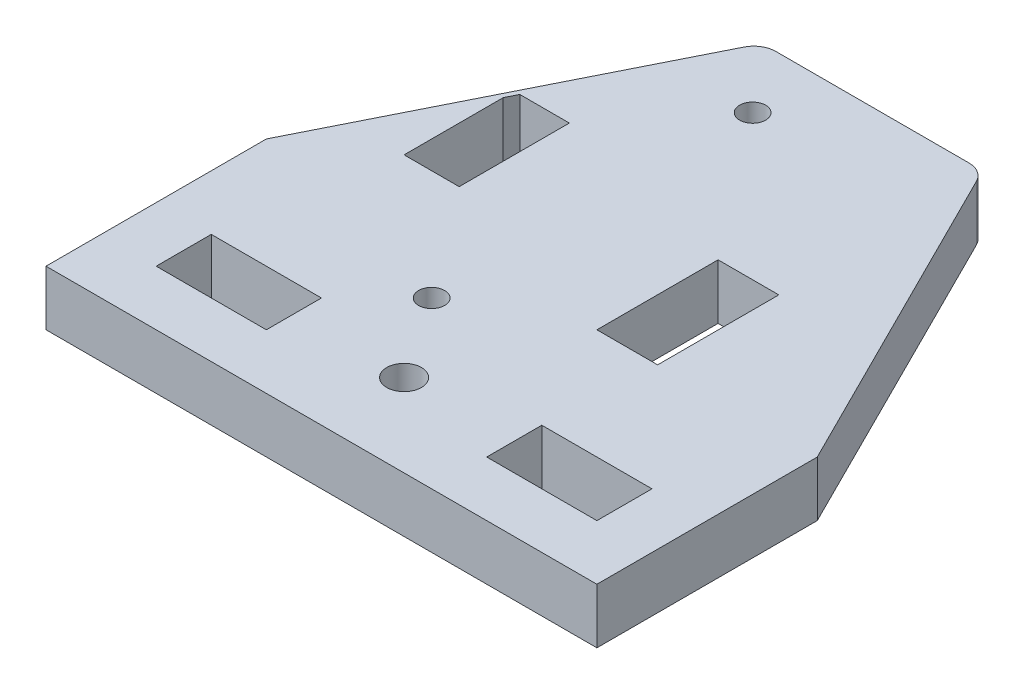
ISO-10303-21;
HEADER;
FILE_DESCRIPTION(('STEP AP214'),'2;1');
FILE_NAME('part.step','',(''),(''),'','','');
FILE_SCHEMA(('AUTOMOTIVE_DESIGN { 1 0 10303 214 1 1 1 1 }'));
ENDSEC;
DATA;
#1=APPLICATION_CONTEXT('core data for automotive mechanical design processes');
#2=APPLICATION_PROTOCOL_DEFINITION('international standard','automotive_design',2000,#1);
#3=PRODUCT_CONTEXT('',#1,'mechanical');
#4=PRODUCT('Part','Part','',(#3));
#5=PRODUCT_RELATED_PRODUCT_CATEGORY('part','',(#4));
#6=PRODUCT_DEFINITION_FORMATION('','',#4);
#7=PRODUCT_DEFINITION_CONTEXT('part definition',#1,'design');
#8=PRODUCT_DEFINITION('design','',#6,#7);
#9=PRODUCT_DEFINITION_SHAPE('','',#8);
#10=(LENGTH_UNIT() NAMED_UNIT(*) SI_UNIT(.MILLI.,.METRE.));
#11=(NAMED_UNIT(*) PLANE_ANGLE_UNIT() SI_UNIT($,.RADIAN.));
#12=(NAMED_UNIT(*) SI_UNIT($,.STERADIAN.) SOLID_ANGLE_UNIT());
#13=UNCERTAINTY_MEASURE_WITH_UNIT(LENGTH_MEASURE(1.E-05),#10,'distance_accuracy_value','');
#14=(GEOMETRIC_REPRESENTATION_CONTEXT(3) GLOBAL_UNCERTAINTY_ASSIGNED_CONTEXT((#13)) GLOBAL_UNIT_ASSIGNED_CONTEXT((#10,
#11,#12)) REPRESENTATION_CONTEXT('',''));
#15=CARTESIAN_POINT('',(0.,0.,0.));
#16=DIRECTION('',(0.,0.,1.));
#17=DIRECTION('',(1.,0.,0.));
#18=AXIS2_PLACEMENT_3D('',#15,#16,#17);
#19=CARTESIAN_POINT('',(0.,6.35,0.));
#20=DIRECTION('',(0.,-1.,0.));
#21=DIRECTION('',(0.,0.,-1.));
#22=AXIS2_PLACEMENT_3D('',#19,#20,#21);
#23=PLANE('',#22);
#24=CARTESIAN_POINT('',(25.4,6.35,-56.05));
#25=DIRECTION('',(0.,1.,0.));
#26=DIRECTION('',(0.,0.,1.));
#27=AXIS2_PLACEMENT_3D('',#24,#25,#26);
#28=CIRCLE('',#27,1.5);
#29=CARTESIAN_POINT('',(25.4,6.35,-54.55));
#30=VERTEX_POINT('',#29);
#31=EDGE_CURVE('E267',#30,#30,#28,.T.);
#32=ORIENTED_EDGE('',*,*,#31,.F.);
#33=EDGE_LOOP('',(#32));
#34=FACE_BOUND('',#33,.T.);
#35=CARTESIAN_POINT('',(25.4,6.35,-19.05));
#36=DIRECTION('',(0.,1.,0.));
#37=DIRECTION('',(0.,0.,1.));
#38=AXIS2_PLACEMENT_3D('',#35,#36,#37);
#39=CIRCLE('',#38,1.5);
#40=CARTESIAN_POINT('',(25.4,6.35,-17.55));
#41=VERTEX_POINT('',#40);
#42=EDGE_CURVE('E273',#41,#41,#39,.T.);
#43=ORIENTED_EDGE('',*,*,#42,.F.);
#44=EDGE_LOOP('',(#43));
#45=FACE_BOUND('',#44,.T.);
#46=DIRECTION('',(0.,0.,-1.));
#47=VECTOR('',#46,1.);
#48=CARTESIAN_POINT('',(45.1,6.35,-39.37));
#49=LINE('',#48,#47);
#50=CARTESIAN_POINT('',(45.1,6.35,-25.4));
#51=VERTEX_POINT('',#50);
#52=CARTESIAN_POINT('',(45.1,6.35,-39.37));
#53=VERTEX_POINT('',#52);
#54=EDGE_CURVE('E279',#51,#53,#49,.T.);
#55=ORIENTED_EDGE('',*,*,#54,.F.);
#56=DIRECTION('',(1.,0.,0.));
#57=VECTOR('',#56,1.);
#58=CARTESIAN_POINT('',(38.1,6.35,-25.4));
#59=LINE('',#58,#57);
#60=CARTESIAN_POINT('',(38.1,6.35,-25.4));
#61=VERTEX_POINT('',#60);
#62=EDGE_CURVE('E287',#61,#51,#59,.T.);
#63=ORIENTED_EDGE('',*,*,#62,.F.);
#64=DIRECTION('',(0.,0.,1.));
#65=VECTOR('',#64,1.);
#66=CARTESIAN_POINT('',(38.1,6.35,-39.37));
#67=LINE('',#66,#65);
#68=CARTESIAN_POINT('',(38.1,6.35,-39.37));
#69=VERTEX_POINT('',#68);
#70=EDGE_CURVE('E284',#69,#61,#67,.T.);
#71=ORIENTED_EDGE('',*,*,#70,.F.);
#72=DIRECTION('',(-1.,0.,0.));
#73=VECTOR('',#72,1.);
#74=CARTESIAN_POINT('',(38.1,6.35,-39.37));
#75=LINE('',#74,#73);
#76=EDGE_CURVE('E281',#53,#69,#75,.T.);
#77=ORIENTED_EDGE('',*,*,#76,.F.);
#78=EDGE_LOOP('',(#55,#63,#71,#77));
#79=FACE_BOUND('',#78,.T.);
#80=DIRECTION('',(0.,0.,1.));
#81=VECTOR('',#80,1.);
#82=CARTESIAN_POINT('',(6.35,6.35,-6.35));
#83=LINE('',#82,#81);
#84=CARTESIAN_POINT('',(6.35,6.35,-12.7));
#85=VERTEX_POINT('',#84);
#86=CARTESIAN_POINT('',(6.35,6.35,-6.35));
#87=VERTEX_POINT('',#86);
#88=EDGE_CURVE('E347',#85,#87,#83,.T.);
#89=ORIENTED_EDGE('',*,*,#88,.F.);
#90=DIRECTION('',(-1.,0.,0.));
#91=VECTOR('',#90,1.);
#92=CARTESIAN_POINT('',(6.35,6.35,-12.7));
#93=LINE('',#92,#91);
#94=CARTESIAN_POINT('',(19.05,6.35,-12.7));
#95=VERTEX_POINT('',#94);
#96=EDGE_CURVE('E355',#95,#85,#93,.T.);
#97=ORIENTED_EDGE('',*,*,#96,.F.);
#98=DIRECTION('',(0.,0.,-1.));
#99=VECTOR('',#98,1.);
#100=CARTESIAN_POINT('',(19.05,6.35,-6.35));
#101=LINE('',#100,#99);
#102=CARTESIAN_POINT('',(19.05,6.35,-6.35));
#103=VERTEX_POINT('',#102);
#104=EDGE_CURVE('E352',#103,#95,#101,.T.);
#105=ORIENTED_EDGE('',*,*,#104,.F.);
#106=DIRECTION('',(1.,0.,0.));
#107=VECTOR('',#106,1.);
#108=CARTESIAN_POINT('',(6.35,6.35,-6.35));
#109=LINE('',#108,#107);
#110=EDGE_CURVE('E349',#87,#103,#109,.T.);
#111=ORIENTED_EDGE('',*,*,#110,.F.);
#112=EDGE_LOOP('',(#89,#97,#105,#111));
#113=FACE_BOUND('',#112,.T.);
#114=DIRECTION('',(0.,0.,1.));
#115=VECTOR('',#114,1.);
#116=CARTESIAN_POINT('',(44.45,6.35,-6.35));
#117=LINE('',#116,#115);
#118=CARTESIAN_POINT('',(44.45,6.35,-12.7));
#119=VERTEX_POINT('',#118);
#120=CARTESIAN_POINT('',(44.45,6.35,-6.35));
#121=VERTEX_POINT('',#120);
#122=EDGE_CURVE('E316',#119,#121,#117,.T.);
#123=ORIENTED_EDGE('',*,*,#122,.F.);
#124=DIRECTION('',(-1.,0.,0.));
#125=VECTOR('',#124,1.);
#126=CARTESIAN_POINT('',(44.45,6.35,-12.7));
#127=LINE('',#126,#125);
#128=CARTESIAN_POINT('',(57.15,6.35,-12.7));
#129=VERTEX_POINT('',#128);
#130=EDGE_CURVE('E324',#129,#119,#127,.T.);
#131=ORIENTED_EDGE('',*,*,#130,.F.);
#132=DIRECTION('',(0.,0.,-1.));
#133=VECTOR('',#132,1.);
#134=CARTESIAN_POINT('',(57.15,6.35,-6.35));
#135=LINE('',#134,#133);
#136=CARTESIAN_POINT('',(57.15,6.35,-6.35));
#137=VERTEX_POINT('',#136);
#138=EDGE_CURVE('E321',#137,#129,#135,.T.);
#139=ORIENTED_EDGE('',*,*,#138,.F.);
#140=DIRECTION('',(1.,0.,0.));
#141=VECTOR('',#140,1.);
#142=CARTESIAN_POINT('',(44.45,6.35,-6.35));
#143=LINE('',#142,#141);
#144=EDGE_CURVE('E318',#121,#137,#143,.T.);
#145=ORIENTED_EDGE('',*,*,#144,.F.);
#146=EDGE_LOOP('',(#123,#131,#139,#145));
#147=FACE_BOUND('',#146,.T.);
#148=CARTESIAN_POINT('',(31.75,6.35,-9.525));
#149=DIRECTION('',(0.,1.,0.));
#150=DIRECTION('',(0.,0.,1.));
#151=AXIS2_PLACEMENT_3D('',#148,#149,#150);
#152=CIRCLE('',#151,2.);
#153=CARTESIAN_POINT('',(31.75,6.35,-7.525));
#154=VERTEX_POINT('',#153);
#155=EDGE_CURVE('E310',#154,#154,#152,.T.);
#156=ORIENTED_EDGE('',*,*,#155,.F.);
#157=EDGE_LOOP('',(#156));
#158=FACE_BOUND('',#157,.T.);
#159=DIRECTION('',(-1.,0.,0.));
#160=VECTOR('',#159,1.);
#161=CARTESIAN_POINT('',(10.16,6.35,-44.45));
#162=LINE('',#161,#160);
#163=CARTESIAN_POINT('',(15.875,6.35,-44.45));
#164=VERTEX_POINT('',#163);
#165=CARTESIAN_POINT('',(10.16,6.35,-44.45));
#166=VERTEX_POINT('',#165);
#167=EDGE_CURVE('E222',#164,#166,#162,.T.);
#168=ORIENTED_EDGE('',*,*,#167,.F.);
#169=DIRECTION('',(0.,0.,-1.));
#170=VECTOR('',#169,1.);
#171=CARTESIAN_POINT('',(15.875,6.35,-44.45));
#172=LINE('',#171,#170);
#173=CARTESIAN_POINT('',(15.875,6.35,-31.75));
#174=VERTEX_POINT('',#173);
#175=EDGE_CURVE('E219',#174,#164,#172,.T.);
#176=ORIENTED_EDGE('',*,*,#175,.F.);
#177=DIRECTION('',(1.,0.,0.));
#178=VECTOR('',#177,1.);
#179=CARTESIAN_POINT('',(9.525,6.35,-31.75));
#180=LINE('',#179,#178);
#181=CARTESIAN_POINT('',(9.525,6.35,-31.75));
#182=VERTEX_POINT('',#181);
#183=EDGE_CURVE('E233',#182,#174,#180,.T.);
#184=ORIENTED_EDGE('',*,*,#183,.F.);
#185=DIRECTION('',(0.,0.,1.));
#186=VECTOR('',#185,1.);
#187=CARTESIAN_POINT('',(9.525,6.35,-43.18));
#188=LINE('',#187,#186);
#189=CARTESIAN_POINT('',(9.525,6.35,-43.18));
#190=VERTEX_POINT('',#189);
#191=EDGE_CURVE('E251',#190,#182,#188,.T.);
#192=ORIENTED_EDGE('',*,*,#191,.F.);
#193=DIRECTION('',(-0.447213595499951,0.,0.894427190999919));
#194=VECTOR('',#193,1.);
#195=CARTESIAN_POINT('',(10.16,6.35,-44.45));
#196=LINE('',#195,#194);
#197=EDGE_CURVE('E248',#166,#190,#196,.T.);
#198=ORIENTED_EDGE('',*,*,#197,.F.);
#199=EDGE_LOOP('',(#168,#176,#184,#192,#198));
#200=FACE_BOUND('',#199,.T.);
#201=CARTESIAN_POINT('',(20.6198063314247,6.35,-60.96));
#202=DIRECTION('',(0.,1.,0.));
#203=DIRECTION('',(0.,0.,1.));
#204=AXIS2_PLACEMENT_3D('',#201,#202,#203);
#205=CIRCLE('',#204,2.54);
#206=CARTESIAN_POINT('',(20.6198063314247,6.35,-63.5));
#207=VERTEX_POINT('',#206);
#208=CARTESIAN_POINT('',(18.3479612662849,6.35,-62.0959225325699));
#209=VERTEX_POINT('',#208);
#210=EDGE_CURVE('E201',#207,#209,#205,.T.);
#211=ORIENTED_EDGE('',*,*,#210,.T.);
#212=DIRECTION('',(-0.447213595499958,0.,0.894427190999916));
#213=VECTOR('',#212,1.);
#214=CARTESIAN_POINT('',(0.,6.35,-25.4));
#215=LINE('',#214,#213);
#216=CARTESIAN_POINT('',(0.,6.35,-25.4));
#217=VERTEX_POINT('',#216);
#218=EDGE_CURVE('E388',#209,#217,#215,.T.);
#219=ORIENTED_EDGE('',*,*,#218,.T.);
#220=DIRECTION('',(0.,0.,1.));
#221=VECTOR('',#220,1.);
#222=CARTESIAN_POINT('',(0.,6.35,0.));
#223=LINE('',#222,#221);
#224=CARTESIAN_POINT('',(0.,6.35,0.));
#225=VERTEX_POINT('',#224);
#226=EDGE_CURVE('E378',#217,#225,#223,.T.);
#227=ORIENTED_EDGE('',*,*,#226,.T.);
#228=DIRECTION('',(1.,0.,0.));
#229=VECTOR('',#228,1.);
#230=CARTESIAN_POINT('',(0.,6.35,0.));
#231=LINE('',#230,#229);
#232=CARTESIAN_POINT('',(63.5,6.35,0.));
#233=VERTEX_POINT('',#232);
#234=EDGE_CURVE('E381',#225,#233,#231,.T.);
#235=ORIENTED_EDGE('',*,*,#234,.T.);
#236=DIRECTION('',(0.,0.,-1.));
#237=VECTOR('',#236,1.);
#238=CARTESIAN_POINT('',(63.5,6.35,0.));
#239=LINE('',#238,#237);
#240=CARTESIAN_POINT('',(63.5,6.35,-25.4));
#241=VERTEX_POINT('',#240);
#242=EDGE_CURVE('E383',#233,#241,#239,.T.);
#243=ORIENTED_EDGE('',*,*,#242,.T.);
#244=DIRECTION('',(-0.447213595499958,0.,-0.894427190999916));
#245=VECTOR('',#244,1.);
#246=CARTESIAN_POINT('',(38.1,6.35,-76.2));
#247=LINE('',#246,#245);
#248=CARTESIAN_POINT('',(45.1520387337151,6.35,-62.0959225325699));
#249=VERTEX_POINT('',#248);
#250=EDGE_CURVE('E385',#241,#249,#247,.T.);
#251=ORIENTED_EDGE('',*,*,#250,.T.);
#252=CARTESIAN_POINT('',(42.8801936685753,6.35,-60.96));
#253=DIRECTION('',(0.,1.,0.));
#254=DIRECTION('',(0.,0.,1.));
#255=AXIS2_PLACEMENT_3D('',#252,#253,#254);
#256=CIRCLE('',#255,2.54);
#257=CARTESIAN_POINT('',(42.8801936685753,6.35,-63.5));
#258=VERTEX_POINT('',#257);
#259=EDGE_CURVE('E206',#249,#258,#256,.T.);
#260=ORIENTED_EDGE('',*,*,#259,.T.);
#261=DIRECTION('',(-1.,0.,0.));
#262=VECTOR('',#261,1.);
#263=CARTESIAN_POINT('',(19.05,6.34999999999999,-63.5));
#264=LINE('',#263,#262);
#265=EDGE_CURVE('E220',#258,#207,#264,.T.);
#266=ORIENTED_EDGE('',*,*,#265,.T.);
#267=EDGE_LOOP('',(#211,#219,#227,#235,#243,#251,#260,#266));
#268=FACE_BOUND('',#267,.T.);
#269=ADVANCED_FACE('F33',(#34,#45,#79,#113,#147,#158,#200,#268),#23,.F.);
#270=CARTESIAN_POINT('',(0.,0.,0.));
#271=DIRECTION('',(0.,-1.,0.));
#272=DIRECTION('',(0.,0.,-1.));
#273=AXIS2_PLACEMENT_3D('',#270,#271,#272);
#274=PLANE('',#273);
#275=DIRECTION('',(0.,0.,-1.));
#276=VECTOR('',#275,1.);
#277=CARTESIAN_POINT('',(15.875,0.,-44.45));
#278=LINE('',#277,#276);
#279=CARTESIAN_POINT('',(15.875,0.,-31.75));
#280=VERTEX_POINT('',#279);
#281=CARTESIAN_POINT('',(15.875,0.,-44.45));
#282=VERTEX_POINT('',#281);
#283=EDGE_CURVE('E229',#280,#282,#278,.T.);
#284=ORIENTED_EDGE('',*,*,#283,.T.);
#285=DIRECTION('',(-1.,0.,0.));
#286=VECTOR('',#285,1.);
#287=CARTESIAN_POINT('',(10.16,0.,-44.45));
#288=LINE('',#287,#286);
#289=CARTESIAN_POINT('',(10.16,0.,-44.45));
#290=VERTEX_POINT('',#289);
#291=EDGE_CURVE('E232',#282,#290,#288,.T.);
#292=ORIENTED_EDGE('',*,*,#291,.T.);
#293=DIRECTION('',(-0.447213595499951,0.,0.894427190999919));
#294=VECTOR('',#293,1.);
#295=CARTESIAN_POINT('',(10.16,0.,-44.45));
#296=LINE('',#295,#294);
#297=CARTESIAN_POINT('',(9.525,0.,-43.18));
#298=VERTEX_POINT('',#297);
#299=EDGE_CURVE('E236',#290,#298,#296,.T.);
#300=ORIENTED_EDGE('',*,*,#299,.T.);
#301=DIRECTION('',(0.,0.,1.));
#302=VECTOR('',#301,1.);
#303=CARTESIAN_POINT('',(9.525,0.,-43.18));
#304=LINE('',#303,#302);
#305=CARTESIAN_POINT('',(9.525,0.,-31.75));
#306=VERTEX_POINT('',#305);
#307=EDGE_CURVE('E239',#298,#306,#304,.T.);
#308=ORIENTED_EDGE('',*,*,#307,.T.);
#309=DIRECTION('',(1.,0.,0.));
#310=VECTOR('',#309,1.);
#311=CARTESIAN_POINT('',(9.525,0.,-31.75));
#312=LINE('',#311,#310);
#313=EDGE_CURVE('E242',#306,#280,#312,.T.);
#314=ORIENTED_EDGE('',*,*,#313,.T.);
#315=EDGE_LOOP('',(#284,#292,#300,#308,#314));
#316=FACE_BOUND('',#315,.T.);
#317=CARTESIAN_POINT('',(25.4,0.,-19.05));
#318=DIRECTION('',(0.,1.,0.));
#319=DIRECTION('',(0.,0.,1.));
#320=AXIS2_PLACEMENT_3D('',#317,#318,#319);
#321=CIRCLE('',#320,1.5);
#322=CARTESIAN_POINT('',(25.4,0.,-17.55));
#323=VERTEX_POINT('',#322);
#324=EDGE_CURVE('E270',#323,#323,#321,.T.);
#325=ORIENTED_EDGE('',*,*,#324,.T.);
#326=EDGE_LOOP('',(#325));
#327=FACE_BOUND('',#326,.T.);
#328=DIRECTION('',(-1.,0.,0.));
#329=VECTOR('',#328,1.);
#330=CARTESIAN_POINT('',(44.45,0.,-12.7));
#331=LINE('',#330,#329);
#332=CARTESIAN_POINT('',(57.15,0.,-12.7));
#333=VERTEX_POINT('',#332);
#334=CARTESIAN_POINT('',(44.45,0.,-12.7));
#335=VERTEX_POINT('',#334);
#336=EDGE_CURVE('E319',#333,#335,#331,.T.);
#337=ORIENTED_EDGE('',*,*,#336,.T.);
#338=DIRECTION('',(0.,0.,1.));
#339=VECTOR('',#338,1.);
#340=CARTESIAN_POINT('',(44.45,0.,-6.35));
#341=LINE('',#340,#339);
#342=CARTESIAN_POINT('',(44.45,0.,-6.35));
#343=VERTEX_POINT('',#342);
#344=EDGE_CURVE('E313',#335,#343,#341,.T.);
#345=ORIENTED_EDGE('',*,*,#344,.T.);
#346=DIRECTION('',(1.,0.,0.));
#347=VECTOR('',#346,1.);
#348=CARTESIAN_POINT('',(44.45,0.,-6.35));
#349=LINE('',#348,#347);
#350=CARTESIAN_POINT('',(57.15,0.,-6.35));
#351=VERTEX_POINT('',#350);
#352=EDGE_CURVE('E329',#343,#351,#349,.T.);
#353=ORIENTED_EDGE('',*,*,#352,.T.);
#354=DIRECTION('',(0.,0.,-1.));
#355=VECTOR('',#354,1.);
#356=CARTESIAN_POINT('',(57.15,0.,-6.35));
#357=LINE('',#356,#355);
#358=EDGE_CURVE('E332',#351,#333,#357,.T.);
#359=ORIENTED_EDGE('',*,*,#358,.T.);
#360=EDGE_LOOP('',(#337,#345,#353,#359));
#361=FACE_BOUND('',#360,.T.);
#362=DIRECTION('',(-1.,0.,0.));
#363=VECTOR('',#362,1.);
#364=CARTESIAN_POINT('',(6.35,0.,-12.7));
#365=LINE('',#364,#363);
#366=CARTESIAN_POINT('',(19.05,0.,-12.7));
#367=VERTEX_POINT('',#366);
#368=CARTESIAN_POINT('',(6.35,0.,-12.7));
#369=VERTEX_POINT('',#368);
#370=EDGE_CURVE('E350',#367,#369,#365,.T.);
#371=ORIENTED_EDGE('',*,*,#370,.T.);
#372=DIRECTION('',(0.,0.,1.));
#373=VECTOR('',#372,1.);
#374=CARTESIAN_POINT('',(6.35,0.,-6.35));
#375=LINE('',#374,#373);
#376=CARTESIAN_POINT('',(6.35,0.,-6.35));
#377=VERTEX_POINT('',#376);
#378=EDGE_CURVE('E346',#369,#377,#375,.T.);
#379=ORIENTED_EDGE('',*,*,#378,.T.);
#380=DIRECTION('',(1.,0.,0.));
#381=VECTOR('',#380,1.);
#382=CARTESIAN_POINT('',(6.35,0.,-6.35));
#383=LINE('',#382,#381);
#384=CARTESIAN_POINT('',(19.05,0.,-6.35));
#385=VERTEX_POINT('',#384);
#386=EDGE_CURVE('E360',#377,#385,#383,.T.);
#387=ORIENTED_EDGE('',*,*,#386,.T.);
#388=DIRECTION('',(0.,0.,-1.));
#389=VECTOR('',#388,1.);
#390=CARTESIAN_POINT('',(19.05,0.,-6.35));
#391=LINE('',#390,#389);
#392=EDGE_CURVE('E363',#385,#367,#391,.T.);
#393=ORIENTED_EDGE('',*,*,#392,.T.);
#394=EDGE_LOOP('',(#371,#379,#387,#393));
#395=FACE_BOUND('',#394,.T.);
#396=CARTESIAN_POINT('',(31.75,0.,-9.525));
#397=DIRECTION('',(0.,1.,0.));
#398=DIRECTION('',(0.,0.,1.));
#399=AXIS2_PLACEMENT_3D('',#396,#397,#398);
#400=CIRCLE('',#399,2.);
#401=CARTESIAN_POINT('',(31.75,0.,-7.525));
#402=VERTEX_POINT('',#401);
#403=EDGE_CURVE('E309',#402,#402,#400,.T.);
#404=ORIENTED_EDGE('',*,*,#403,.T.);
#405=EDGE_LOOP('',(#404));
#406=FACE_BOUND('',#405,.T.);
#407=DIRECTION('',(1.,0.,0.));
#408=VECTOR('',#407,1.);
#409=CARTESIAN_POINT('',(38.1,0.,-25.4));
#410=LINE('',#409,#408);
#411=CARTESIAN_POINT('',(38.1,0.,-25.4));
#412=VERTEX_POINT('',#411);
#413=CARTESIAN_POINT('',(45.1,0.,-25.4));
#414=VERTEX_POINT('',#413);
#415=EDGE_CURVE('E282',#412,#414,#410,.T.);
#416=ORIENTED_EDGE('',*,*,#415,.T.);
#417=DIRECTION('',(0.,0.,-1.));
#418=VECTOR('',#417,1.);
#419=CARTESIAN_POINT('',(45.1,0.,-39.37));
#420=LINE('',#419,#418);
#421=CARTESIAN_POINT('',(45.1,0.,-39.37));
#422=VERTEX_POINT('',#421);
#423=EDGE_CURVE('E276',#414,#422,#420,.T.);
#424=ORIENTED_EDGE('',*,*,#423,.T.);
#425=DIRECTION('',(-1.,0.,0.));
#426=VECTOR('',#425,1.);
#427=CARTESIAN_POINT('',(38.1,0.,-39.37));
#428=LINE('',#427,#426);
#429=CARTESIAN_POINT('',(38.1,0.,-39.37));
#430=VERTEX_POINT('',#429);
#431=EDGE_CURVE('E292',#422,#430,#428,.T.);
#432=ORIENTED_EDGE('',*,*,#431,.T.);
#433=DIRECTION('',(0.,0.,1.));
#434=VECTOR('',#433,1.);
#435=CARTESIAN_POINT('',(38.1,0.,-39.37));
#436=LINE('',#435,#434);
#437=EDGE_CURVE('E295',#430,#412,#436,.T.);
#438=ORIENTED_EDGE('',*,*,#437,.T.);
#439=EDGE_LOOP('',(#416,#424,#432,#438));
#440=FACE_BOUND('',#439,.T.);
#441=CARTESIAN_POINT('',(25.4,0.,-56.05));
#442=DIRECTION('',(0.,1.,0.));
#443=DIRECTION('',(0.,0.,1.));
#444=AXIS2_PLACEMENT_3D('',#441,#442,#443);
#445=CIRCLE('',#444,1.5);
#446=CARTESIAN_POINT('',(25.4,0.,-54.55));
#447=VERTEX_POINT('',#446);
#448=EDGE_CURVE('E258',#447,#447,#445,.T.);
#449=ORIENTED_EDGE('',*,*,#448,.T.);
#450=EDGE_LOOP('',(#449));
#451=FACE_BOUND('',#450,.T.);
#452=DIRECTION('',(-0.447213595499958,0.,0.894427190999916));
#453=VECTOR('',#452,1.);
#454=CARTESIAN_POINT('',(0.,0.,-25.4));
#455=LINE('',#454,#453);
#456=CARTESIAN_POINT('',(18.3479612662849,0.,-62.0959225325699));
#457=VERTEX_POINT('',#456);
#458=CARTESIAN_POINT('',(0.,0.,-25.4));
#459=VERTEX_POINT('',#458);
#460=EDGE_CURVE('E215',#457,#459,#455,.T.);
#461=ORIENTED_EDGE('',*,*,#460,.F.);
#462=CARTESIAN_POINT('',(20.6198063314247,0.,-60.96));
#463=DIRECTION('',(0.,1.,0.));
#464=DIRECTION('',(0.,0.,1.));
#465=AXIS2_PLACEMENT_3D('',#462,#463,#464);
#466=CIRCLE('',#465,2.54);
#467=CARTESIAN_POINT('',(20.6198063314247,0.,-63.5));
#468=VERTEX_POINT('',#467);
#469=EDGE_CURVE('E48',#468,#457,#466,.T.);
#470=ORIENTED_EDGE('',*,*,#469,.F.);
#471=DIRECTION('',(-1.,0.,0.));
#472=VECTOR('',#471,1.);
#473=CARTESIAN_POINT('',(19.05,0.,-63.5));
#474=LINE('',#473,#472);
#475=CARTESIAN_POINT('',(42.8801936685753,0.,-63.5));
#476=VERTEX_POINT('',#475);
#477=EDGE_CURVE('E213',#476,#468,#474,.T.);
#478=ORIENTED_EDGE('',*,*,#477,.F.);
#479=CARTESIAN_POINT('',(42.8801936685753,0.,-60.96));
#480=DIRECTION('',(0.,1.,0.));
#481=DIRECTION('',(0.,0.,1.));
#482=AXIS2_PLACEMENT_3D('',#479,#480,#481);
#483=CIRCLE('',#482,2.54);
#484=CARTESIAN_POINT('',(45.1520387337151,0.,-62.0959225325699));
#485=VERTEX_POINT('',#484);
#486=EDGE_CURVE('E56',#485,#476,#483,.T.);
#487=ORIENTED_EDGE('',*,*,#486,.F.);
#488=DIRECTION('',(-0.447213595499958,0.,-0.894427190999916));
#489=VECTOR('',#488,1.);
#490=CARTESIAN_POINT('',(38.1,0.,-76.2));
#491=LINE('',#490,#489);
#492=CARTESIAN_POINT('',(63.5,0.,-25.4));
#493=VERTEX_POINT('',#492);
#494=EDGE_CURVE('E397',#493,#485,#491,.T.);
#495=ORIENTED_EDGE('',*,*,#494,.F.);
#496=DIRECTION('',(0.,0.,-1.));
#497=VECTOR('',#496,1.);
#498=CARTESIAN_POINT('',(63.5,0.,0.));
#499=LINE('',#498,#497);
#500=CARTESIAN_POINT('',(63.5,0.,0.));
#501=VERTEX_POINT('',#500);
#502=EDGE_CURVE('E395',#501,#493,#499,.T.);
#503=ORIENTED_EDGE('',*,*,#502,.F.);
#504=DIRECTION('',(1.,0.,0.));
#505=VECTOR('',#504,1.);
#506=CARTESIAN_POINT('',(0.,0.,0.));
#507=LINE('',#506,#505);
#508=CARTESIAN_POINT('',(0.,0.,0.));
#509=VERTEX_POINT('',#508);
#510=EDGE_CURVE('E393',#509,#501,#507,.T.);
#511=ORIENTED_EDGE('',*,*,#510,.F.);
#512=DIRECTION('',(0.,0.,1.));
#513=VECTOR('',#512,1.);
#514=CARTESIAN_POINT('',(0.,0.,0.));
#515=LINE('',#514,#513);
#516=EDGE_CURVE('E377',#459,#509,#515,.T.);
#517=ORIENTED_EDGE('',*,*,#516,.F.);
#518=EDGE_LOOP('',(#461,#470,#478,#487,#495,#503,#511,#517));
#519=FACE_BOUND('',#518,.T.);
#520=ADVANCED_FACE('F212',(#316,#327,#361,#395,#406,#440,#451,#519),#274,.T.);
#521=CARTESIAN_POINT('',(19.05,130.591526999832,-63.5));
#522=DIRECTION('',(0.,0.,-1.));
#523=DIRECTION('',(-1.,0.,0.));
#524=AXIS2_PLACEMENT_3D('',#521,#522,#523);
#525=PLANE('',#524);
#526=ORIENTED_EDGE('',*,*,#477,.T.);
#527=DIRECTION('',(0.,1.,0.));
#528=VECTOR('',#527,1.);
#529=CARTESIAN_POINT('',(20.6198063314247,0.,-63.5));
#530=LINE('',#529,#528);
#531=EDGE_CURVE('E198',#468,#207,#530,.T.);
#532=ORIENTED_EDGE('',*,*,#531,.T.);
#533=ORIENTED_EDGE('',*,*,#265,.F.);
#534=DIRECTION('',(0.,1.,0.));
#535=VECTOR('',#534,1.);
#536=CARTESIAN_POINT('',(42.8801936685753,0.,-63.5));
#537=LINE('',#536,#535);
#538=EDGE_CURVE('E218',#476,#258,#537,.T.);
#539=ORIENTED_EDGE('',*,*,#538,.F.);
#540=EDGE_LOOP('',(#526,#532,#533,#539));
#541=FACE_BOUND('',#540,.T.);
#542=ADVANCED_FACE('F217',(#541),#525,.T.);
#543=CARTESIAN_POINT('',(0.,6.35,-25.4));
#544=DIRECTION('',(0.894427190999916,0.,0.447213595499958));
#545=DIRECTION('',(0.447213595499958,0.,-0.894427190999916));
#546=AXIS2_PLACEMENT_3D('',#543,#544,#545);
#547=PLANE('',#546);
#548=DIRECTION('',(0.,1.,0.));
#549=VECTOR('',#548,1.);
#550=CARTESIAN_POINT('',(18.3479612662849,0.,-62.0959225325699));
#551=LINE('',#550,#549);
#552=EDGE_CURVE('E207',#457,#209,#551,.T.);
#553=ORIENTED_EDGE('',*,*,#552,.F.);
#554=ORIENTED_EDGE('',*,*,#460,.T.);
#555=DIRECTION('',(0.,-1.,0.));
#556=VECTOR('',#555,1.);
#557=CARTESIAN_POINT('',(0.,6.35,-25.4));
#558=LINE('',#557,#556);
#559=EDGE_CURVE('E390',#217,#459,#558,.T.);
#560=ORIENTED_EDGE('',*,*,#559,.F.);
#561=ORIENTED_EDGE('',*,*,#218,.F.);
#562=EDGE_LOOP('',(#553,#554,#560,#561));
#563=FACE_BOUND('',#562,.T.);
#564=ADVANCED_FACE('F427',(#563),#547,.F.);
#565=CARTESIAN_POINT('',(38.1,6.35,-76.2));
#566=DIRECTION('',(-0.894427190999916,0.,0.447213595499958));
#567=DIRECTION('',(0.447213595499958,0.,0.894427190999916));
#568=AXIS2_PLACEMENT_3D('',#565,#566,#567);
#569=PLANE('',#568);
#570=ORIENTED_EDGE('',*,*,#494,.T.);
#571=DIRECTION('',(0.,1.,0.));
#572=VECTOR('',#571,1.);
#573=CARTESIAN_POINT('',(45.1520387337151,0.,-62.0959225325699));
#574=LINE('',#573,#572);
#575=EDGE_CURVE('E224',#485,#249,#574,.T.);
#576=ORIENTED_EDGE('',*,*,#575,.T.);
#577=ORIENTED_EDGE('',*,*,#250,.F.);
#578=DIRECTION('',(0.,-1.,0.));
#579=VECTOR('',#578,1.);
#580=CARTESIAN_POINT('',(63.5,6.35,-25.4));
#581=LINE('',#580,#579);
#582=EDGE_CURVE('E403',#241,#493,#581,.T.);
#583=ORIENTED_EDGE('',*,*,#582,.T.);
#584=EDGE_LOOP('',(#570,#576,#577,#583));
#585=FACE_BOUND('',#584,.T.);
#586=ADVANCED_FACE('F416',(#585),#569,.F.);
#587=CARTESIAN_POINT('',(0.,6.35,0.));
#588=DIRECTION('',(1.,0.,0.));
#589=DIRECTION('',(0.,0.,-1.));
#590=AXIS2_PLACEMENT_3D('',#587,#588,#589);
#591=PLANE('',#590);
#592=ORIENTED_EDGE('',*,*,#516,.T.);
#593=DIRECTION('',(0.,-1.,0.));
#594=VECTOR('',#593,1.);
#595=CARTESIAN_POINT('',(0.,6.35,0.));
#596=LINE('',#595,#594);
#597=EDGE_CURVE('E11',#225,#509,#596,.T.);
#598=ORIENTED_EDGE('',*,*,#597,.F.);
#599=ORIENTED_EDGE('',*,*,#226,.F.);
#600=ORIENTED_EDGE('',*,*,#559,.T.);
#601=EDGE_LOOP('',(#592,#598,#599,#600));
#602=FACE_BOUND('',#601,.T.);
#603=ADVANCED_FACE('F35',(#602),#591,.F.);
#604=CARTESIAN_POINT('',(0.,6.35,0.));
#605=DIRECTION('',(0.,0.,-1.));
#606=DIRECTION('',(-1.,0.,0.));
#607=AXIS2_PLACEMENT_3D('',#604,#605,#606);
#608=PLANE('',#607);
#609=ORIENTED_EDGE('',*,*,#510,.T.);
#610=DIRECTION('',(0.,-1.,0.));
#611=VECTOR('',#610,1.);
#612=CARTESIAN_POINT('',(63.5,6.35,0.));
#613=LINE('',#612,#611);
#614=EDGE_CURVE('E41',#233,#501,#613,.T.);
#615=ORIENTED_EDGE('',*,*,#614,.F.);
#616=ORIENTED_EDGE('',*,*,#234,.F.);
#617=ORIENTED_EDGE('',*,*,#597,.T.);
#618=EDGE_LOOP('',(#609,#615,#616,#617));
#619=FACE_BOUND('',#618,.T.);
#620=ADVANCED_FACE('F422',(#619),#608,.F.);
#621=CARTESIAN_POINT('',(63.5,6.35,0.));
#622=DIRECTION('',(-1.,0.,0.));
#623=DIRECTION('',(0.,0.,1.));
#624=AXIS2_PLACEMENT_3D('',#621,#622,#623);
#625=PLANE('',#624);
#626=ORIENTED_EDGE('',*,*,#502,.T.);
#627=ORIENTED_EDGE('',*,*,#582,.F.);
#628=ORIENTED_EDGE('',*,*,#242,.F.);
#629=ORIENTED_EDGE('',*,*,#614,.T.);
#630=EDGE_LOOP('',(#626,#627,#628,#629));
#631=FACE_BOUND('',#630,.T.);
#632=ADVANCED_FACE('F410',(#631),#625,.F.);
#633=CARTESIAN_POINT('',(6.35,6.35,-6.35));
#634=DIRECTION('',(1.,0.,0.));
#635=DIRECTION('',(0.,0.,-1.));
#636=AXIS2_PLACEMENT_3D('',#633,#634,#635);
#637=PLANE('',#636);
#638=ORIENTED_EDGE('',*,*,#378,.F.);
#639=DIRECTION('',(0.,-1.,0.));
#640=VECTOR('',#639,1.);
#641=CARTESIAN_POINT('',(6.35,6.35,-12.7));
#642=LINE('',#641,#640);
#643=EDGE_CURVE('E357',#85,#369,#642,.T.);
#644=ORIENTED_EDGE('',*,*,#643,.F.);
#645=ORIENTED_EDGE('',*,*,#88,.T.);
#646=DIRECTION('',(0.,-1.,0.));
#647=VECTOR('',#646,1.);
#648=CARTESIAN_POINT('',(6.35,6.35,-6.35));
#649=LINE('',#648,#647);
#650=EDGE_CURVE('E374',#87,#377,#649,.T.);
#651=ORIENTED_EDGE('',*,*,#650,.T.);
#652=EDGE_LOOP('',(#638,#644,#645,#651));
#653=FACE_BOUND('',#652,.T.);
#654=ADVANCED_FACE('F458',(#653),#637,.T.);
#655=CARTESIAN_POINT('',(6.35,6.35,-6.35));
#656=DIRECTION('',(0.,0.,-1.));
#657=DIRECTION('',(-1.,0.,0.));
#658=AXIS2_PLACEMENT_3D('',#655,#656,#657);
#659=PLANE('',#658);
#660=ORIENTED_EDGE('',*,*,#386,.F.);
#661=ORIENTED_EDGE('',*,*,#650,.F.);
#662=ORIENTED_EDGE('',*,*,#110,.T.);
#663=DIRECTION('',(0.,-1.,0.));
#664=VECTOR('',#663,1.);
#665=CARTESIAN_POINT('',(19.05,6.35,-6.35));
#666=LINE('',#665,#664);
#667=EDGE_CURVE('E372',#103,#385,#666,.T.);
#668=ORIENTED_EDGE('',*,*,#667,.T.);
#669=EDGE_LOOP('',(#660,#661,#662,#668));
#670=FACE_BOUND('',#669,.T.);
#671=ADVANCED_FACE('F491',(#670),#659,.T.);
#672=CARTESIAN_POINT('',(19.05,6.35,-6.35));
#673=DIRECTION('',(-1.,0.,0.));
#674=DIRECTION('',(0.,0.,1.));
#675=AXIS2_PLACEMENT_3D('',#672,#673,#674);
#676=PLANE('',#675);
#677=ORIENTED_EDGE('',*,*,#392,.F.);
#678=ORIENTED_EDGE('',*,*,#667,.F.);
#679=ORIENTED_EDGE('',*,*,#104,.T.);
#680=DIRECTION('',(0.,-1.,0.));
#681=VECTOR('',#680,1.);
#682=CARTESIAN_POINT('',(19.05,6.35,-12.7));
#683=LINE('',#682,#681);
#684=EDGE_CURVE('E370',#95,#367,#683,.T.);
#685=ORIENTED_EDGE('',*,*,#684,.T.);
#686=EDGE_LOOP('',(#677,#678,#679,#685));
#687=FACE_BOUND('',#686,.T.);
#688=ADVANCED_FACE('F500',(#687),#676,.T.);
#689=CARTESIAN_POINT('',(6.35,6.35,-12.7));
#690=DIRECTION('',(0.,0.,1.));
#691=DIRECTION('',(1.,0.,0.));
#692=AXIS2_PLACEMENT_3D('',#689,#690,#691);
#693=PLANE('',#692);
#694=ORIENTED_EDGE('',*,*,#370,.F.);
#695=ORIENTED_EDGE('',*,*,#684,.F.);
#696=ORIENTED_EDGE('',*,*,#96,.T.);
#697=ORIENTED_EDGE('',*,*,#643,.T.);
#698=EDGE_LOOP('',(#694,#695,#696,#697));
#699=FACE_BOUND('',#698,.T.);
#700=ADVANCED_FACE('F509',(#699),#693,.T.);
#701=CARTESIAN_POINT('',(44.45,6.35,-6.35));
#702=DIRECTION('',(1.,0.,0.));
#703=DIRECTION('',(0.,0.,-1.));
#704=AXIS2_PLACEMENT_3D('',#701,#702,#703);
#705=PLANE('',#704);
#706=ORIENTED_EDGE('',*,*,#344,.F.);
#707=DIRECTION('',(0.,-1.,0.));
#708=VECTOR('',#707,1.);
#709=CARTESIAN_POINT('',(44.45,6.35,-12.7));
#710=LINE('',#709,#708);
#711=EDGE_CURVE('E326',#119,#335,#710,.T.);
#712=ORIENTED_EDGE('',*,*,#711,.F.);
#713=ORIENTED_EDGE('',*,*,#122,.T.);
#714=DIRECTION('',(0.,-1.,0.));
#715=VECTOR('',#714,1.);
#716=CARTESIAN_POINT('',(44.45,6.35,-6.35));
#717=LINE('',#716,#715);
#718=EDGE_CURVE('E343',#121,#343,#717,.T.);
#719=ORIENTED_EDGE('',*,*,#718,.T.);
#720=EDGE_LOOP('',(#706,#712,#713,#719));
#721=FACE_BOUND('',#720,.T.);
#722=ADVANCED_FACE('F519',(#721),#705,.T.);
#723=CARTESIAN_POINT('',(44.45,6.35,-6.35));
#724=DIRECTION('',(0.,0.,-1.));
#725=DIRECTION('',(-1.,0.,0.));
#726=AXIS2_PLACEMENT_3D('',#723,#724,#725);
#727=PLANE('',#726);
#728=ORIENTED_EDGE('',*,*,#352,.F.);
#729=ORIENTED_EDGE('',*,*,#718,.F.);
#730=ORIENTED_EDGE('',*,*,#144,.T.);
#731=DIRECTION('',(0.,-1.,0.));
#732=VECTOR('',#731,1.);
#733=CARTESIAN_POINT('',(57.15,6.35,-6.35));
#734=LINE('',#733,#732);
#735=EDGE_CURVE('E341',#137,#351,#734,.T.);
#736=ORIENTED_EDGE('',*,*,#735,.T.);
#737=EDGE_LOOP('',(#728,#729,#730,#736));
#738=FACE_BOUND('',#737,.T.);
#739=ADVANCED_FACE('F529',(#738),#727,.T.);
#740=CARTESIAN_POINT('',(57.15,6.35,-6.35));
#741=DIRECTION('',(-1.,0.,0.));
#742=DIRECTION('',(0.,0.,1.));
#743=AXIS2_PLACEMENT_3D('',#740,#741,#742);
#744=PLANE('',#743);
#745=ORIENTED_EDGE('',*,*,#358,.F.);
#746=ORIENTED_EDGE('',*,*,#735,.F.);
#747=ORIENTED_EDGE('',*,*,#138,.T.);
#748=DIRECTION('',(0.,-1.,0.));
#749=VECTOR('',#748,1.);
#750=CARTESIAN_POINT('',(57.15,6.35,-12.7));
#751=LINE('',#750,#749);
#752=EDGE_CURVE('E339',#129,#333,#751,.T.);
#753=ORIENTED_EDGE('',*,*,#752,.T.);
#754=EDGE_LOOP('',(#745,#746,#747,#753));
#755=FACE_BOUND('',#754,.T.);
#756=ADVANCED_FACE('F539',(#755),#744,.T.);
#757=CARTESIAN_POINT('',(44.45,6.35,-12.7));
#758=DIRECTION('',(0.,0.,1.));
#759=DIRECTION('',(1.,0.,0.));
#760=AXIS2_PLACEMENT_3D('',#757,#758,#759);
#761=PLANE('',#760);
#762=ORIENTED_EDGE('',*,*,#336,.F.);
#763=ORIENTED_EDGE('',*,*,#752,.F.);
#764=ORIENTED_EDGE('',*,*,#130,.T.);
#765=ORIENTED_EDGE('',*,*,#711,.T.);
#766=EDGE_LOOP('',(#762,#763,#764,#765));
#767=FACE_BOUND('',#766,.T.);
#768=ADVANCED_FACE('F549',(#767),#761,.T.);
#769=CARTESIAN_POINT('',(31.75,6.35,-9.525));
#770=DIRECTION('',(0.,-1.,0.));
#771=DIRECTION('',(0.,0.,-1.));
#772=AXIS2_PLACEMENT_3D('',#769,#770,#771);
#773=CYLINDRICAL_SURFACE('',#772,2.);
#774=ORIENTED_EDGE('',*,*,#155,.T.);
#775=EDGE_LOOP('',(#774));
#776=FACE_BOUND('',#775,.T.);
#777=ORIENTED_EDGE('',*,*,#403,.F.);
#778=EDGE_LOOP('',(#777));
#779=FACE_BOUND('',#778,.T.);
#780=ADVANCED_FACE('F559',(#776,#779),#773,.F.);
#781=CARTESIAN_POINT('',(45.1,6.35,-39.37));
#782=DIRECTION('',(-1.,0.,0.));
#783=DIRECTION('',(0.,0.,1.));
#784=AXIS2_PLACEMENT_3D('',#781,#782,#783);
#785=PLANE('',#784);
#786=ORIENTED_EDGE('',*,*,#423,.F.);
#787=DIRECTION('',(0.,-1.,0.));
#788=VECTOR('',#787,1.);
#789=CARTESIAN_POINT('',(45.1,6.35,-25.4));
#790=LINE('',#789,#788);
#791=EDGE_CURVE('E289',#51,#414,#790,.T.);
#792=ORIENTED_EDGE('',*,*,#791,.F.);
#793=ORIENTED_EDGE('',*,*,#54,.T.);
#794=DIRECTION('',(0.,-1.,0.));
#795=VECTOR('',#794,1.);
#796=CARTESIAN_POINT('',(45.1,6.35,-39.37));
#797=LINE('',#796,#795);
#798=EDGE_CURVE('E306',#53,#422,#797,.T.);
#799=ORIENTED_EDGE('',*,*,#798,.T.);
#800=EDGE_LOOP('',(#786,#792,#793,#799));
#801=FACE_BOUND('',#800,.T.);
#802=ADVANCED_FACE('F569',(#801),#785,.T.);
#803=CARTESIAN_POINT('',(38.1,6.35,-39.37));
#804=DIRECTION('',(0.,0.,1.));
#805=DIRECTION('',(1.,0.,0.));
#806=AXIS2_PLACEMENT_3D('',#803,#804,#805);
#807=PLANE('',#806);
#808=ORIENTED_EDGE('',*,*,#431,.F.);
#809=ORIENTED_EDGE('',*,*,#798,.F.);
#810=ORIENTED_EDGE('',*,*,#76,.T.);
#811=DIRECTION('',(0.,-1.,0.));
#812=VECTOR('',#811,1.);
#813=CARTESIAN_POINT('',(38.1,6.35,-39.37));
#814=LINE('',#813,#812);
#815=EDGE_CURVE('E304',#69,#430,#814,.T.);
#816=ORIENTED_EDGE('',*,*,#815,.T.);
#817=EDGE_LOOP('',(#808,#809,#810,#816));
#818=FACE_BOUND('',#817,.T.);
#819=ADVANCED_FACE('F579',(#818),#807,.T.);
#820=CARTESIAN_POINT('',(38.1,6.35,-39.37));
#821=DIRECTION('',(1.,0.,0.));
#822=DIRECTION('',(0.,0.,-1.));
#823=AXIS2_PLACEMENT_3D('',#820,#821,#822);
#824=PLANE('',#823);
#825=ORIENTED_EDGE('',*,*,#437,.F.);
#826=ORIENTED_EDGE('',*,*,#815,.F.);
#827=ORIENTED_EDGE('',*,*,#70,.T.);
#828=DIRECTION('',(0.,-1.,0.));
#829=VECTOR('',#828,1.);
#830=CARTESIAN_POINT('',(38.1,6.35,-25.4));
#831=LINE('',#830,#829);
#832=EDGE_CURVE('E302',#61,#412,#831,.T.);
#833=ORIENTED_EDGE('',*,*,#832,.T.);
#834=EDGE_LOOP('',(#825,#826,#827,#833));
#835=FACE_BOUND('',#834,.T.);
#836=ADVANCED_FACE('F589',(#835),#824,.T.);
#837=CARTESIAN_POINT('',(38.1,6.35,-25.4));
#838=DIRECTION('',(0.,0.,-1.));
#839=DIRECTION('',(-1.,0.,0.));
#840=AXIS2_PLACEMENT_3D('',#837,#838,#839);
#841=PLANE('',#840);
#842=ORIENTED_EDGE('',*,*,#415,.F.);
#843=ORIENTED_EDGE('',*,*,#832,.F.);
#844=ORIENTED_EDGE('',*,*,#62,.T.);
#845=ORIENTED_EDGE('',*,*,#791,.T.);
#846=EDGE_LOOP('',(#842,#843,#844,#845));
#847=FACE_BOUND('',#846,.T.);
#848=ADVANCED_FACE('F599',(#847),#841,.T.);
#849=CARTESIAN_POINT('',(25.4,6.35,-19.05));
#850=DIRECTION('',(0.,-1.,0.));
#851=DIRECTION('',(0.,0.,-1.));
#852=AXIS2_PLACEMENT_3D('',#849,#850,#851);
#853=CYLINDRICAL_SURFACE('',#852,1.5);
#854=ORIENTED_EDGE('',*,*,#42,.T.);
#855=EDGE_LOOP('',(#854));
#856=FACE_BOUND('',#855,.T.);
#857=ORIENTED_EDGE('',*,*,#324,.F.);
#858=EDGE_LOOP('',(#857));
#859=FACE_BOUND('',#858,.T.);
#860=ADVANCED_FACE('F609',(#856,#859),#853,.F.);
#861=CARTESIAN_POINT('',(25.4,6.35,-56.05));
#862=DIRECTION('',(0.,-1.,0.));
#863=DIRECTION('',(0.,0.,-1.));
#864=AXIS2_PLACEMENT_3D('',#861,#862,#863);
#865=CYLINDRICAL_SURFACE('',#864,1.5);
#866=ORIENTED_EDGE('',*,*,#31,.T.);
#867=EDGE_LOOP('',(#866));
#868=FACE_BOUND('',#867,.T.);
#869=ORIENTED_EDGE('',*,*,#448,.F.);
#870=EDGE_LOOP('',(#869));
#871=FACE_BOUND('',#870,.T.);
#872=ADVANCED_FACE('F619',(#868,#871),#865,.F.);
#873=CARTESIAN_POINT('',(15.875,0.,-44.45));
#874=DIRECTION('',(1.,0.,0.));
#875=DIRECTION('',(0.,0.,-1.));
#876=AXIS2_PLACEMENT_3D('',#873,#874,#875);
#877=PLANE('',#876);
#878=ORIENTED_EDGE('',*,*,#175,.T.);
#879=DIRECTION('',(0.,1.,0.));
#880=VECTOR('',#879,1.);
#881=CARTESIAN_POINT('',(15.875,0.,-44.45));
#882=LINE('',#881,#880);
#883=EDGE_CURVE('E244',#282,#164,#882,.T.);
#884=ORIENTED_EDGE('',*,*,#883,.F.);
#885=ORIENTED_EDGE('',*,*,#283,.F.);
#886=DIRECTION('',(0.,1.,0.));
#887=VECTOR('',#886,1.);
#888=CARTESIAN_POINT('',(15.875,0.,-31.75));
#889=LINE('',#888,#887);
#890=EDGE_CURVE('E256',#280,#174,#889,.T.);
#891=ORIENTED_EDGE('',*,*,#890,.T.);
#892=EDGE_LOOP('',(#878,#884,#885,#891));
#893=FACE_BOUND('',#892,.T.);
#894=ADVANCED_FACE('F629',(#893),#877,.F.);
#895=CARTESIAN_POINT('',(9.525,0.,-31.75));
#896=DIRECTION('',(0.,0.,1.));
#897=DIRECTION('',(1.,0.,0.));
#898=AXIS2_PLACEMENT_3D('',#895,#896,#897);
#899=PLANE('',#898);
#900=ORIENTED_EDGE('',*,*,#183,.T.);
#901=ORIENTED_EDGE('',*,*,#890,.F.);
#902=ORIENTED_EDGE('',*,*,#313,.F.);
#903=DIRECTION('',(0.,1.,0.));
#904=VECTOR('',#903,1.);
#905=CARTESIAN_POINT('',(9.525,0.,-31.75));
#906=LINE('',#905,#904);
#907=EDGE_CURVE('E259',#306,#182,#906,.T.);
#908=ORIENTED_EDGE('',*,*,#907,.T.);
#909=EDGE_LOOP('',(#900,#901,#902,#908));
#910=FACE_BOUND('',#909,.T.);
#911=ADVANCED_FACE('F639',(#910),#899,.F.);
#912=CARTESIAN_POINT('',(9.525,0.,-43.18));
#913=DIRECTION('',(-1.,0.,0.));
#914=DIRECTION('',(0.,0.,1.));
#915=AXIS2_PLACEMENT_3D('',#912,#913,#914);
#916=PLANE('',#915);
#917=ORIENTED_EDGE('',*,*,#191,.T.);
#918=ORIENTED_EDGE('',*,*,#907,.F.);
#919=ORIENTED_EDGE('',*,*,#307,.F.);
#920=DIRECTION('',(0.,1.,0.));
#921=VECTOR('',#920,1.);
#922=CARTESIAN_POINT('',(9.525,0.,-43.18));
#923=LINE('',#922,#921);
#924=EDGE_CURVE('E261',#298,#190,#923,.T.);
#925=ORIENTED_EDGE('',*,*,#924,.T.);
#926=EDGE_LOOP('',(#917,#918,#919,#925));
#927=FACE_BOUND('',#926,.T.);
#928=ADVANCED_FACE('F649',(#927),#916,.F.);
#929=CARTESIAN_POINT('',(10.16,0.,-44.45));
#930=DIRECTION('',(-0.894427190999919,0.,-0.447213595499951));
#931=DIRECTION('',(-0.447213595499951,0.,0.894427190999919));
#932=AXIS2_PLACEMENT_3D('',#929,#930,#931);
#933=PLANE('',#932);
#934=ORIENTED_EDGE('',*,*,#197,.T.);
#935=ORIENTED_EDGE('',*,*,#924,.F.);
#936=ORIENTED_EDGE('',*,*,#299,.F.);
#937=DIRECTION('',(0.,1.,0.));
#938=VECTOR('',#937,1.);
#939=CARTESIAN_POINT('',(10.16,0.,-44.45));
#940=LINE('',#939,#938);
#941=EDGE_CURVE('E263',#290,#166,#940,.T.);
#942=ORIENTED_EDGE('',*,*,#941,.T.);
#943=EDGE_LOOP('',(#934,#935,#936,#942));
#944=FACE_BOUND('',#943,.T.);
#945=ADVANCED_FACE('F442',(#944),#933,.F.);
#946=CARTESIAN_POINT('',(10.16,0.,-44.45));
#947=DIRECTION('',(0.,0.,-1.));
#948=DIRECTION('',(-1.,0.,0.));
#949=AXIS2_PLACEMENT_3D('',#946,#947,#948);
#950=PLANE('',#949);
#951=ORIENTED_EDGE('',*,*,#167,.T.);
#952=ORIENTED_EDGE('',*,*,#941,.F.);
#953=ORIENTED_EDGE('',*,*,#291,.F.);
#954=ORIENTED_EDGE('',*,*,#883,.T.);
#955=EDGE_LOOP('',(#951,#952,#953,#954));
#956=FACE_BOUND('',#955,.T.);
#957=ADVANCED_FACE('F434',(#956),#950,.F.);
#958=CARTESIAN_POINT('',(42.8801936685753,0.,-60.96));
#959=DIRECTION('',(0.,1.,0.));
#960=DIRECTION('',(0.,0.,1.));
#961=AXIS2_PLACEMENT_3D('',#958,#959,#960);
#962=CYLINDRICAL_SURFACE('',#961,2.54);
#963=ORIENTED_EDGE('',*,*,#259,.F.);
#964=ORIENTED_EDGE('',*,*,#575,.F.);
#965=ORIENTED_EDGE('',*,*,#486,.T.);
#966=ORIENTED_EDGE('',*,*,#538,.T.);
#967=EDGE_LOOP('',(#963,#964,#965,#966));
#968=FACE_BOUND('',#967,.T.);
#969=ADVANCED_FACE('F432',(#968),#962,.T.);
#970=CARTESIAN_POINT('',(20.6198063314247,0.,-60.96));
#971=DIRECTION('',(0.,1.,0.));
#972=DIRECTION('',(0.,0.,1.));
#973=AXIS2_PLACEMENT_3D('',#970,#971,#972);
#974=CYLINDRICAL_SURFACE('',#973,2.54);
#975=ORIENTED_EDGE('',*,*,#210,.F.);
#976=ORIENTED_EDGE('',*,*,#531,.F.);
#977=ORIENTED_EDGE('',*,*,#469,.T.);
#978=ORIENTED_EDGE('',*,*,#552,.T.);
#979=EDGE_LOOP('',(#975,#976,#977,#978));
#980=FACE_BOUND('',#979,.T.);
#981=ADVANCED_FACE('F199',(#980),#974,.T.);
#982=CLOSED_SHELL('',(#269,#520,#542,#564,#586,#603,#620,#632,#654,#671,#688,#700,#722,#739,
#756,#768,#780,#802,#819,#836,#848,#860,#872,#894,#911,#928,#945,#957,#969,#981));
#983=MANIFOLD_SOLID_BREP('B2',#982);
#984=ADVANCED_BREP_SHAPE_REPRESENTATION('',(#18,#983),#14);
#985=SHAPE_DEFINITION_REPRESENTATION(#9,#984);
ENDSEC;
END-ISO-10303-21;
